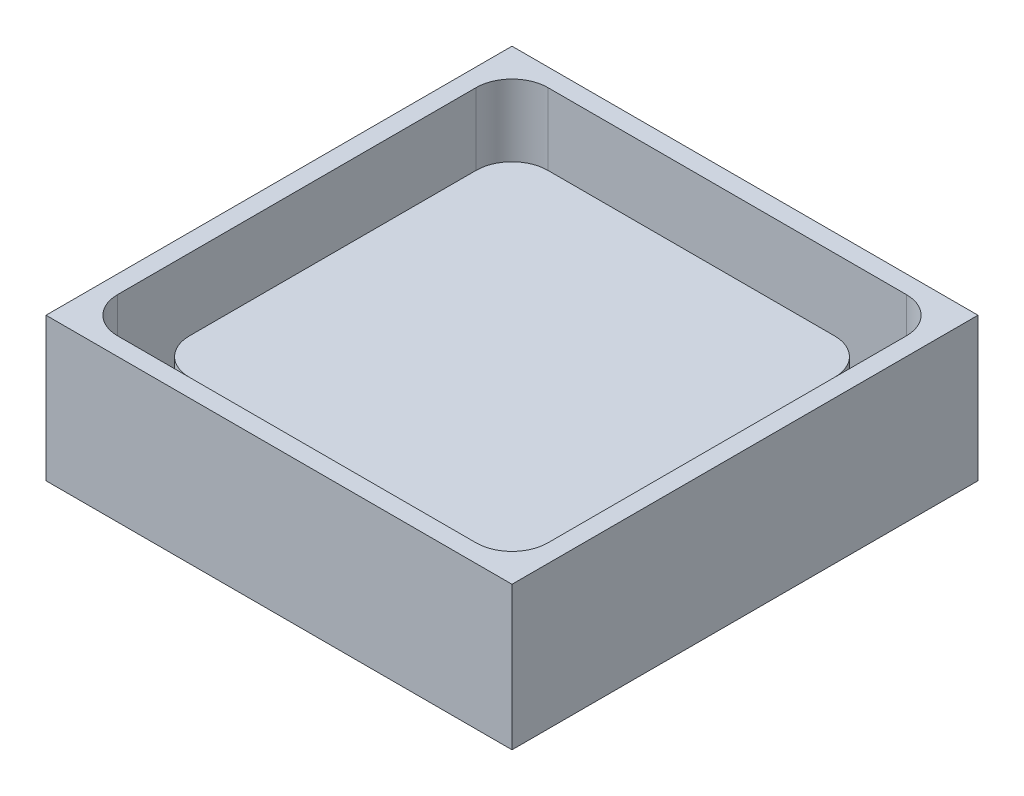
ISO-10303-21;
HEADER;
FILE_DESCRIPTION(('STEP AP214'),'2;1');
FILE_NAME('part.step','',(''),(''),'','','');
FILE_SCHEMA(('AUTOMOTIVE_DESIGN { 1 0 10303 214 1 1 1 1 }'));
ENDSEC;
DATA;
#1=APPLICATION_CONTEXT('core data for automotive mechanical design processes');
#2=APPLICATION_PROTOCOL_DEFINITION('international standard','automotive_design',2000,#1);
#3=PRODUCT_CONTEXT('',#1,'mechanical');
#4=PRODUCT('Part','Part','',(#3));
#5=PRODUCT_RELATED_PRODUCT_CATEGORY('part','',(#4));
#6=PRODUCT_DEFINITION_FORMATION('','',#4);
#7=PRODUCT_DEFINITION_CONTEXT('part definition',#1,'design');
#8=PRODUCT_DEFINITION('design','',#6,#7);
#9=PRODUCT_DEFINITION_SHAPE('','',#8);
#10=(LENGTH_UNIT() NAMED_UNIT(*) SI_UNIT(.MILLI.,.METRE.));
#11=(NAMED_UNIT(*) PLANE_ANGLE_UNIT() SI_UNIT($,.RADIAN.));
#12=(NAMED_UNIT(*) SI_UNIT($,.STERADIAN.) SOLID_ANGLE_UNIT());
#13=UNCERTAINTY_MEASURE_WITH_UNIT(LENGTH_MEASURE(1.E-05),#10,'distance_accuracy_value','');
#14=(GEOMETRIC_REPRESENTATION_CONTEXT(3) GLOBAL_UNCERTAINTY_ASSIGNED_CONTEXT((#13)) GLOBAL_UNIT_ASSIGNED_CONTEXT((#10,
#11,#12)) REPRESENTATION_CONTEXT('',''));
#15=CARTESIAN_POINT('',(0.,0.,0.));
#16=DIRECTION('',(0.,0.,1.));
#17=DIRECTION('',(1.,0.,0.));
#18=AXIS2_PLACEMENT_3D('',#15,#16,#17);
#19=CARTESIAN_POINT('',(10.,6.,10.));
#20=DIRECTION('',(-1.,0.,0.));
#21=DIRECTION('',(0.,0.,1.));
#22=AXIS2_PLACEMENT_3D('',#19,#20,#21);
#23=PLANE('',#22);
#24=DIRECTION('',(0.,0.,-1.));
#25=VECTOR('',#24,1.);
#26=CARTESIAN_POINT('',(10.,6.,10.));
#27=LINE('',#26,#25);
#28=CARTESIAN_POINT('',(10.,6.,8.));
#29=VERTEX_POINT('',#28);
#30=CARTESIAN_POINT('',(10.,6.,-8.));
#31=VERTEX_POINT('',#30);
#32=EDGE_CURVE('E226',#29,#31,#27,.T.);
#33=ORIENTED_EDGE('',*,*,#32,.F.);
#34=DIRECTION('',(0.,-1.,0.));
#35=VECTOR('',#34,1.);
#36=CARTESIAN_POINT('',(10.,6.,8.));
#37=LINE('',#36,#35);
#38=CARTESIAN_POINT('',(10.,1.,8.));
#39=VERTEX_POINT('',#38);
#40=EDGE_CURVE('E261',#29,#39,#37,.T.);
#41=ORIENTED_EDGE('',*,*,#40,.T.);
#42=DIRECTION('',(0.,0.,-1.));
#43=VECTOR('',#42,1.);
#44=CARTESIAN_POINT('',(10.,1.,10.));
#45=LINE('',#44,#43);
#46=CARTESIAN_POINT('',(10.,1.,-8.));
#47=VERTEX_POINT('',#46);
#48=EDGE_CURVE('E223',#39,#47,#45,.T.);
#49=ORIENTED_EDGE('',*,*,#48,.T.);
#50=DIRECTION('',(0.,-1.,0.));
#51=VECTOR('',#50,1.);
#52=CARTESIAN_POINT('',(10.,6.,-8.));
#53=LINE('',#52,#51);
#54=EDGE_CURVE('E259',#47,#31,#53,.F.);
#55=ORIENTED_EDGE('',*,*,#54,.T.);
#56=EDGE_LOOP('',(#33,#41,#49,#55));
#57=FACE_BOUND('',#56,.T.);
#58=ADVANCED_FACE('F39',(#57),#23,.F.);
#59=CARTESIAN_POINT('',(-10.,6.,-10.));
#60=DIRECTION('',(0.,0.,1.));
#61=DIRECTION('',(1.,0.,0.));
#62=AXIS2_PLACEMENT_3D('',#59,#60,#61);
#63=PLANE('',#62);
#64=DIRECTION('',(-1.,0.,0.));
#65=VECTOR('',#64,1.);
#66=CARTESIAN_POINT('',(-10.,6.,-10.));
#67=LINE('',#66,#65);
#68=CARTESIAN_POINT('',(8.,6.,-10.));
#69=VERTEX_POINT('',#68);
#70=CARTESIAN_POINT('',(-8.,6.,-10.));
#71=VERTEX_POINT('',#70);
#72=EDGE_CURVE('E229',#69,#71,#67,.T.);
#73=ORIENTED_EDGE('',*,*,#72,.F.);
#74=DIRECTION('',(0.,-1.,0.));
#75=VECTOR('',#74,1.);
#76=CARTESIAN_POINT('',(8.,6.,-10.));
#77=LINE('',#76,#75);
#78=CARTESIAN_POINT('',(8.,1.,-10.));
#79=VERTEX_POINT('',#78);
#80=EDGE_CURVE('E266',#69,#79,#77,.T.);
#81=ORIENTED_EDGE('',*,*,#80,.T.);
#82=DIRECTION('',(-1.,0.,0.));
#83=VECTOR('',#82,1.);
#84=CARTESIAN_POINT('',(-10.,1.,-10.));
#85=LINE('',#84,#83);
#86=CARTESIAN_POINT('',(-8.,1.,-10.));
#87=VERTEX_POINT('',#86);
#88=EDGE_CURVE('E220',#79,#87,#85,.T.);
#89=ORIENTED_EDGE('',*,*,#88,.T.);
#90=DIRECTION('',(0.,-1.,0.));
#91=VECTOR('',#90,1.);
#92=CARTESIAN_POINT('',(-8.,6.,-10.));
#93=LINE('',#92,#91);
#94=EDGE_CURVE('E264',#87,#71,#93,.F.);
#95=ORIENTED_EDGE('',*,*,#94,.T.);
#96=EDGE_LOOP('',(#73,#81,#89,#95));
#97=FACE_BOUND('',#96,.T.);
#98=ADVANCED_FACE('F380',(#97),#63,.F.);
#99=CARTESIAN_POINT('',(-10.,6.,10.));
#100=DIRECTION('',(1.,0.,0.));
#101=DIRECTION('',(0.,0.,-1.));
#102=AXIS2_PLACEMENT_3D('',#99,#100,#101);
#103=PLANE('',#102);
#104=DIRECTION('',(0.,0.,1.));
#105=VECTOR('',#104,1.);
#106=CARTESIAN_POINT('',(-10.,1.,10.));
#107=LINE('',#106,#105);
#108=CARTESIAN_POINT('',(-10.,1.,-8.));
#109=VERTEX_POINT('',#108);
#110=CARTESIAN_POINT('',(-10.,1.,8.));
#111=VERTEX_POINT('',#110);
#112=EDGE_CURVE('E217',#109,#111,#107,.T.);
#113=ORIENTED_EDGE('',*,*,#112,.T.);
#114=DIRECTION('',(0.,-1.,0.));
#115=VECTOR('',#114,1.);
#116=CARTESIAN_POINT('',(-10.,6.,8.));
#117=LINE('',#116,#115);
#118=CARTESIAN_POINT('',(-10.,6.,8.));
#119=VERTEX_POINT('',#118);
#120=EDGE_CURVE('E249',#111,#119,#117,.F.);
#121=ORIENTED_EDGE('',*,*,#120,.T.);
#122=DIRECTION('',(0.,0.,1.));
#123=VECTOR('',#122,1.);
#124=CARTESIAN_POINT('',(-10.,6.,10.));
#125=LINE('',#124,#123);
#126=CARTESIAN_POINT('',(-10.,6.,-8.));
#127=VERTEX_POINT('',#126);
#128=EDGE_CURVE('E232',#127,#119,#125,.T.);
#129=ORIENTED_EDGE('',*,*,#128,.F.);
#130=DIRECTION('',(0.,-1.,0.));
#131=VECTOR('',#130,1.);
#132=CARTESIAN_POINT('',(-10.,6.,-8.));
#133=LINE('',#132,#131);
#134=EDGE_CURVE('E246',#127,#109,#133,.T.);
#135=ORIENTED_EDGE('',*,*,#134,.T.);
#136=EDGE_LOOP('',(#113,#121,#129,#135));
#137=FACE_BOUND('',#136,.T.);
#138=ADVANCED_FACE('F387',(#137),#103,.F.);
#139=CARTESIAN_POINT('',(-10.,6.,10.));
#140=DIRECTION('',(0.,0.,-1.));
#141=DIRECTION('',(-1.,0.,0.));
#142=AXIS2_PLACEMENT_3D('',#139,#140,#141);
#143=PLANE('',#142);
#144=DIRECTION('',(1.,0.,0.));
#145=VECTOR('',#144,1.);
#146=CARTESIAN_POINT('',(-10.,6.,10.));
#147=LINE('',#146,#145);
#148=CARTESIAN_POINT('',(-8.,6.,10.));
#149=VERTEX_POINT('',#148);
#150=CARTESIAN_POINT('',(8.,6.,10.));
#151=VERTEX_POINT('',#150);
#152=EDGE_CURVE('E235',#149,#151,#147,.T.);
#153=ORIENTED_EDGE('',*,*,#152,.F.);
#154=DIRECTION('',(0.,-1.,0.));
#155=VECTOR('',#154,1.);
#156=CARTESIAN_POINT('',(-8.,6.,10.));
#157=LINE('',#156,#155);
#158=CARTESIAN_POINT('',(-8.,1.,10.));
#159=VERTEX_POINT('',#158);
#160=EDGE_CURVE('E243',#149,#159,#157,.T.);
#161=ORIENTED_EDGE('',*,*,#160,.T.);
#162=DIRECTION('',(1.,0.,0.));
#163=VECTOR('',#162,1.);
#164=CARTESIAN_POINT('',(-10.,1.,10.));
#165=LINE('',#164,#163);
#166=CARTESIAN_POINT('',(8.,1.,10.));
#167=VERTEX_POINT('',#166);
#168=EDGE_CURVE('E238',#159,#167,#165,.T.);
#169=ORIENTED_EDGE('',*,*,#168,.T.);
#170=DIRECTION('',(0.,-1.,0.));
#171=VECTOR('',#170,1.);
#172=CARTESIAN_POINT('',(8.,6.,10.));
#173=LINE('',#172,#171);
#174=EDGE_CURVE('E241',#167,#151,#173,.F.);
#175=ORIENTED_EDGE('',*,*,#174,.T.);
#176=EDGE_LOOP('',(#153,#161,#169,#175));
#177=FACE_BOUND('',#176,.T.);
#178=ADVANCED_FACE('F554',(#177),#143,.F.);
#179=CARTESIAN_POINT('',(0.,6.,0.));
#180=DIRECTION('',(0.,-1.,0.));
#181=DIRECTION('',(0.,0.,-1.));
#182=AXIS2_PLACEMENT_3D('',#179,#180,#181);
#183=PLANE('',#182);
#184=ORIENTED_EDGE('',*,*,#128,.T.);
#185=CARTESIAN_POINT('',(-8.,6.,8.));
#186=DIRECTION('',(0.,-1.,0.));
#187=DIRECTION('',(0.,0.,-1.));
#188=AXIS2_PLACEMENT_3D('',#185,#186,#187);
#189=CIRCLE('',#188,2.);
#190=EDGE_CURVE('E257',#119,#149,#189,.F.);
#191=ORIENTED_EDGE('',*,*,#190,.T.);
#192=ORIENTED_EDGE('',*,*,#152,.T.);
#193=CARTESIAN_POINT('',(8.,6.,8.));
#194=DIRECTION('',(0.,-1.,0.));
#195=DIRECTION('',(0.,0.,-1.));
#196=AXIS2_PLACEMENT_3D('',#193,#194,#195);
#197=CIRCLE('',#196,2.);
#198=EDGE_CURVE('E255',#151,#29,#197,.F.);
#199=ORIENTED_EDGE('',*,*,#198,.T.);
#200=ORIENTED_EDGE('',*,*,#32,.T.);
#201=CARTESIAN_POINT('',(8.,6.,-8.));
#202=DIRECTION('',(0.,-1.,0.));
#203=DIRECTION('',(0.,0.,-1.));
#204=AXIS2_PLACEMENT_3D('',#201,#202,#203);
#205=CIRCLE('',#204,2.);
#206=EDGE_CURVE('E253',#31,#69,#205,.F.);
#207=ORIENTED_EDGE('',*,*,#206,.T.);
#208=ORIENTED_EDGE('',*,*,#72,.T.);
#209=CARTESIAN_POINT('',(-8.,6.,-8.));
#210=DIRECTION('',(0.,-1.,0.));
#211=DIRECTION('',(0.,0.,-1.));
#212=AXIS2_PLACEMENT_3D('',#209,#210,#211);
#213=CIRCLE('',#212,2.);
#214=EDGE_CURVE('E251',#71,#127,#213,.F.);
#215=ORIENTED_EDGE('',*,*,#214,.T.);
#216=EDGE_LOOP('',(#184,#191,#192,#199,#200,#207,#208,#215));
#217=FACE_BOUND('',#216,.T.);
#218=ADVANCED_FACE('F540',(#217),#183,.F.);
#219=CARTESIAN_POINT('',(0.,1.,0.));
#220=DIRECTION('',(0.,1.,0.));
#221=DIRECTION('',(0.,0.,1.));
#222=AXIS2_PLACEMENT_3D('',#219,#220,#221);
#223=PLANE('',#222);
#224=DIRECTION('',(1.,0.,0.));
#225=VECTOR('',#224,1.);
#226=CARTESIAN_POINT('',(-12.,1.,12.));
#227=LINE('',#226,#225);
#228=CARTESIAN_POINT('',(-10.,1.,12.));
#229=VERTEX_POINT('',#228);
#230=CARTESIAN_POINT('',(10.,1.,12.));
#231=VERTEX_POINT('',#230);
#232=EDGE_CURVE('E211',#229,#231,#227,.T.);
#233=ORIENTED_EDGE('',*,*,#232,.T.);
#234=CARTESIAN_POINT('',(10.,1.,10.));
#235=DIRECTION('',(0.,1.,0.));
#236=DIRECTION('',(0.,0.,1.));
#237=AXIS2_PLACEMENT_3D('',#234,#235,#236);
#238=CIRCLE('',#237,2.);
#239=CARTESIAN_POINT('',(12.,1.,10.));
#240=VERTEX_POINT('',#239);
#241=EDGE_CURVE('E288',#231,#240,#238,.T.);
#242=ORIENTED_EDGE('',*,*,#241,.T.);
#243=DIRECTION('',(0.,0.,-1.));
#244=VECTOR('',#243,1.);
#245=CARTESIAN_POINT('',(12.,1.,12.));
#246=LINE('',#245,#244);
#247=CARTESIAN_POINT('',(12.,1.,-10.));
#248=VERTEX_POINT('',#247);
#249=EDGE_CURVE('E203',#240,#248,#246,.T.);
#250=ORIENTED_EDGE('',*,*,#249,.T.);
#251=CARTESIAN_POINT('',(10.,1.,-10.));
#252=DIRECTION('',(0.,1.,0.));
#253=DIRECTION('',(0.,0.,1.));
#254=AXIS2_PLACEMENT_3D('',#251,#252,#253);
#255=CIRCLE('',#254,2.);
#256=CARTESIAN_POINT('',(10.,1.,-12.));
#257=VERTEX_POINT('',#256);
#258=EDGE_CURVE('E284',#248,#257,#255,.T.);
#259=ORIENTED_EDGE('',*,*,#258,.T.);
#260=DIRECTION('',(1.,0.,0.));
#261=VECTOR('',#260,1.);
#262=CARTESIAN_POINT('',(-12.,1.,-12.));
#263=LINE('',#262,#261);
#264=CARTESIAN_POINT('',(-10.,1.,-12.));
#265=VERTEX_POINT('',#264);
#266=EDGE_CURVE('E201',#265,#257,#263,.T.);
#267=ORIENTED_EDGE('',*,*,#266,.F.);
#268=CARTESIAN_POINT('',(-10.,1.,-10.));
#269=DIRECTION('',(0.,1.,0.));
#270=DIRECTION('',(0.,0.,1.));
#271=AXIS2_PLACEMENT_3D('',#268,#269,#270);
#272=CIRCLE('',#271,2.);
#273=CARTESIAN_POINT('',(-12.,1.,-10.));
#274=VERTEX_POINT('',#273);
#275=EDGE_CURVE('E282',#265,#274,#272,.T.);
#276=ORIENTED_EDGE('',*,*,#275,.T.);
#277=DIRECTION('',(0.,0.,-1.));
#278=VECTOR('',#277,1.);
#279=CARTESIAN_POINT('',(-12.,1.,12.));
#280=LINE('',#279,#278);
#281=CARTESIAN_POINT('',(-12.,1.,10.));
#282=VERTEX_POINT('',#281);
#283=EDGE_CURVE('E214',#282,#274,#280,.T.);
#284=ORIENTED_EDGE('',*,*,#283,.F.);
#285=CARTESIAN_POINT('',(-10.,1.,10.));
#286=DIRECTION('',(0.,1.,0.));
#287=DIRECTION('',(0.,0.,1.));
#288=AXIS2_PLACEMENT_3D('',#285,#286,#287);
#289=CIRCLE('',#288,2.);
#290=EDGE_CURVE('E286',#282,#229,#289,.T.);
#291=ORIENTED_EDGE('',*,*,#290,.T.);
#292=EDGE_LOOP('',(#233,#242,#250,#259,#267,#276,#284,#291));
#293=FACE_BOUND('',#292,.T.);
#294=ORIENTED_EDGE('',*,*,#48,.F.);
#295=CARTESIAN_POINT('',(8.,1.,8.));
#296=DIRECTION('',(0.,1.,0.));
#297=DIRECTION('',(0.,0.,1.));
#298=AXIS2_PLACEMENT_3D('',#295,#296,#297);
#299=CIRCLE('',#298,2.);
#300=EDGE_CURVE('E271',#39,#167,#299,.F.);
#301=ORIENTED_EDGE('',*,*,#300,.T.);
#302=ORIENTED_EDGE('',*,*,#168,.F.);
#303=CARTESIAN_POINT('',(-8.,1.,8.));
#304=DIRECTION('',(0.,1.,0.));
#305=DIRECTION('',(0.,0.,1.));
#306=AXIS2_PLACEMENT_3D('',#303,#304,#305);
#307=CIRCLE('',#306,2.);
#308=EDGE_CURVE('E269',#159,#111,#307,.F.);
#309=ORIENTED_EDGE('',*,*,#308,.T.);
#310=ORIENTED_EDGE('',*,*,#112,.F.);
#311=CARTESIAN_POINT('',(-8.,1.,-8.));
#312=DIRECTION('',(0.,1.,0.));
#313=DIRECTION('',(0.,0.,1.));
#314=AXIS2_PLACEMENT_3D('',#311,#312,#313);
#315=CIRCLE('',#314,2.);
#316=EDGE_CURVE('E275',#109,#87,#315,.F.);
#317=ORIENTED_EDGE('',*,*,#316,.T.);
#318=ORIENTED_EDGE('',*,*,#88,.F.);
#319=CARTESIAN_POINT('',(8.,1.,-8.));
#320=DIRECTION('',(0.,1.,0.));
#321=DIRECTION('',(0.,0.,1.));
#322=AXIS2_PLACEMENT_3D('',#319,#320,#321);
#323=CIRCLE('',#322,2.);
#324=EDGE_CURVE('E273',#79,#47,#323,.F.);
#325=ORIENTED_EDGE('',*,*,#324,.T.);
#326=EDGE_LOOP('',(#294,#301,#302,#309,#310,#317,#318,#325));
#327=FACE_BOUND('',#326,.T.);
#328=ADVANCED_FACE('F323',(#293,#327),#223,.T.);
#329=CARTESIAN_POINT('',(0.,8.,0.));
#330=DIRECTION('',(0.,-1.,0.));
#331=DIRECTION('',(0.,0.,-1.));
#332=AXIS2_PLACEMENT_3D('',#329,#330,#331);
#333=PLANE('',#332);
#334=DIRECTION('',(0.,0.,-1.));
#335=VECTOR('',#334,1.);
#336=CARTESIAN_POINT('',(13.,8.,13.));
#337=LINE('',#336,#335);
#338=CARTESIAN_POINT('',(13.,8.,13.));
#339=VERTEX_POINT('',#338);
#340=CARTESIAN_POINT('',(13.,8.,-13.));
#341=VERTEX_POINT('',#340);
#342=EDGE_CURVE('E187',#339,#341,#337,.T.);
#343=ORIENTED_EDGE('',*,*,#342,.T.);
#344=DIRECTION('',(-1.,0.,0.));
#345=VECTOR('',#344,1.);
#346=CARTESIAN_POINT('',(-13.,8.,-13.));
#347=LINE('',#346,#345);
#348=CARTESIAN_POINT('',(-13.,8.,-13.));
#349=VERTEX_POINT('',#348);
#350=EDGE_CURVE('E176',#341,#349,#347,.T.);
#351=ORIENTED_EDGE('',*,*,#350,.T.);
#352=DIRECTION('',(0.,0.,1.));
#353=VECTOR('',#352,1.);
#354=CARTESIAN_POINT('',(-13.,8.,13.));
#355=LINE('',#354,#353);
#356=CARTESIAN_POINT('',(-13.,8.,13.));
#357=VERTEX_POINT('',#356);
#358=EDGE_CURVE('E186',#349,#357,#355,.T.);
#359=ORIENTED_EDGE('',*,*,#358,.T.);
#360=DIRECTION('',(1.,0.,0.));
#361=VECTOR('',#360,1.);
#362=CARTESIAN_POINT('',(-13.,8.,13.));
#363=LINE('',#362,#361);
#364=EDGE_CURVE('E192',#357,#339,#363,.T.);
#365=ORIENTED_EDGE('',*,*,#364,.T.);
#366=EDGE_LOOP('',(#343,#351,#359,#365));
#367=FACE_BOUND('',#366,.T.);
#368=DIRECTION('',(0.,0.,-1.));
#369=VECTOR('',#368,1.);
#370=CARTESIAN_POINT('',(12.,8.,12.));
#371=LINE('',#370,#369);
#372=CARTESIAN_POINT('',(12.,8.,10.));
#373=VERTEX_POINT('',#372);
#374=CARTESIAN_POINT('',(12.,8.,-10.));
#375=VERTEX_POINT('',#374);
#376=EDGE_CURVE('E310',#373,#375,#371,.T.);
#377=ORIENTED_EDGE('',*,*,#376,.F.);
#378=CARTESIAN_POINT('',(10.,8.,10.));
#379=DIRECTION('',(0.,-1.,0.));
#380=DIRECTION('',(0.,0.,-1.));
#381=AXIS2_PLACEMENT_3D('',#378,#379,#380);
#382=CIRCLE('',#381,2.);
#383=CARTESIAN_POINT('',(10.,8.,12.));
#384=VERTEX_POINT('',#383);
#385=EDGE_CURVE('E304',#373,#384,#382,.T.);
#386=ORIENTED_EDGE('',*,*,#385,.T.);
#387=DIRECTION('',(1.,0.,0.));
#388=VECTOR('',#387,1.);
#389=CARTESIAN_POINT('',(-12.,8.,12.));
#390=LINE('',#389,#388);
#391=CARTESIAN_POINT('',(-10.,8.,12.));
#392=VERTEX_POINT('',#391);
#393=EDGE_CURVE('E345',#392,#384,#390,.T.);
#394=ORIENTED_EDGE('',*,*,#393,.F.);
#395=CARTESIAN_POINT('',(-10.,8.,10.));
#396=DIRECTION('',(0.,-1.,0.));
#397=DIRECTION('',(0.,0.,-1.));
#398=AXIS2_PLACEMENT_3D('',#395,#396,#397);
#399=CIRCLE('',#398,2.);
#400=CARTESIAN_POINT('',(-12.,8.,10.));
#401=VERTEX_POINT('',#400);
#402=EDGE_CURVE('E306',#392,#401,#399,.T.);
#403=ORIENTED_EDGE('',*,*,#402,.T.);
#404=DIRECTION('',(0.,0.,1.));
#405=VECTOR('',#404,1.);
#406=CARTESIAN_POINT('',(-12.,8.,12.));
#407=LINE('',#406,#405);
#408=CARTESIAN_POINT('',(-12.,8.,-10.));
#409=VERTEX_POINT('',#408);
#410=EDGE_CURVE('E334',#409,#401,#407,.T.);
#411=ORIENTED_EDGE('',*,*,#410,.F.);
#412=CARTESIAN_POINT('',(-10.,8.,-10.));
#413=DIRECTION('',(0.,-1.,0.));
#414=DIRECTION('',(0.,0.,-1.));
#415=AXIS2_PLACEMENT_3D('',#412,#413,#414);
#416=CIRCLE('',#415,2.);
#417=CARTESIAN_POINT('',(-10.,8.,-12.));
#418=VERTEX_POINT('',#417);
#419=EDGE_CURVE('E11',#409,#418,#416,.T.);
#420=ORIENTED_EDGE('',*,*,#419,.T.);
#421=DIRECTION('',(-1.,0.,0.));
#422=VECTOR('',#421,1.);
#423=CARTESIAN_POINT('',(-12.,8.,-12.));
#424=LINE('',#423,#422);
#425=CARTESIAN_POINT('',(10.,8.,-12.));
#426=VERTEX_POINT('',#425);
#427=EDGE_CURVE('E312',#426,#418,#424,.T.);
#428=ORIENTED_EDGE('',*,*,#427,.F.);
#429=CARTESIAN_POINT('',(10.,8.,-10.));
#430=DIRECTION('',(0.,-1.,0.));
#431=DIRECTION('',(0.,0.,-1.));
#432=AXIS2_PLACEMENT_3D('',#429,#430,#431);
#433=CIRCLE('',#432,2.);
#434=EDGE_CURVE('E47',#426,#375,#433,.T.);
#435=ORIENTED_EDGE('',*,*,#434,.T.);
#436=EDGE_LOOP('',(#377,#386,#394,#403,#411,#420,#428,#435));
#437=FACE_BOUND('',#436,.T.);
#438=ADVANCED_FACE('F190',(#367,#437),#333,.F.);
#439=CARTESIAN_POINT('',(13.,8.,13.));
#440=DIRECTION('',(-1.,0.,0.));
#441=DIRECTION('',(0.,0.,1.));
#442=AXIS2_PLACEMENT_3D('',#439,#440,#441);
#443=PLANE('',#442);
#444=DIRECTION('',(0.,0.,-1.));
#445=VECTOR('',#444,1.);
#446=CARTESIAN_POINT('',(13.,0.,13.));
#447=LINE('',#446,#445);
#448=CARTESIAN_POINT('',(13.,0.,13.));
#449=VERTEX_POINT('',#448);
#450=CARTESIAN_POINT('',(13.,0.,-13.));
#451=VERTEX_POINT('',#450);
#452=EDGE_CURVE('E200',#449,#451,#447,.T.);
#453=ORIENTED_EDGE('',*,*,#452,.T.);
#454=DIRECTION('',(0.,-1.,0.));
#455=VECTOR('',#454,1.);
#456=CARTESIAN_POINT('',(13.,8.,-13.));
#457=LINE('',#456,#455);
#458=EDGE_CURVE('E180',#341,#451,#457,.T.);
#459=ORIENTED_EDGE('',*,*,#458,.F.);
#460=ORIENTED_EDGE('',*,*,#342,.F.);
#461=DIRECTION('',(0.,-1.,0.));
#462=VECTOR('',#461,1.);
#463=CARTESIAN_POINT('',(13.,8.,13.));
#464=LINE('',#463,#462);
#465=EDGE_CURVE('E355',#339,#449,#464,.T.);
#466=ORIENTED_EDGE('',*,*,#465,.T.);
#467=EDGE_LOOP('',(#453,#459,#460,#466));
#468=FACE_BOUND('',#467,.T.);
#469=ADVANCED_FACE('F198',(#468),#443,.F.);
#470=CARTESIAN_POINT('',(-13.,8.,-13.));
#471=DIRECTION('',(0.,0.,1.));
#472=DIRECTION('',(1.,0.,0.));
#473=AXIS2_PLACEMENT_3D('',#470,#471,#472);
#474=PLANE('',#473);
#475=DIRECTION('',(-1.,0.,0.));
#476=VECTOR('',#475,1.);
#477=CARTESIAN_POINT('',(-13.,0.,-13.));
#478=LINE('',#477,#476);
#479=CARTESIAN_POINT('',(-13.,0.,-13.));
#480=VERTEX_POINT('',#479);
#481=EDGE_CURVE('E349',#451,#480,#478,.T.);
#482=ORIENTED_EDGE('',*,*,#481,.T.);
#483=DIRECTION('',(0.,-1.,0.));
#484=VECTOR('',#483,1.);
#485=CARTESIAN_POINT('',(-13.,8.,-13.));
#486=LINE('',#485,#484);
#487=EDGE_CURVE('E183',#349,#480,#486,.T.);
#488=ORIENTED_EDGE('',*,*,#487,.F.);
#489=ORIENTED_EDGE('',*,*,#350,.F.);
#490=ORIENTED_EDGE('',*,*,#458,.T.);
#491=EDGE_LOOP('',(#482,#488,#489,#490));
#492=FACE_BOUND('',#491,.T.);
#493=ADVANCED_FACE('F178',(#492),#474,.F.);
#494=CARTESIAN_POINT('',(-13.,8.,13.));
#495=DIRECTION('',(1.,0.,0.));
#496=DIRECTION('',(0.,0.,-1.));
#497=AXIS2_PLACEMENT_3D('',#494,#495,#496);
#498=PLANE('',#497);
#499=DIRECTION('',(0.,0.,1.));
#500=VECTOR('',#499,1.);
#501=CARTESIAN_POINT('',(-13.,0.,13.));
#502=LINE('',#501,#500);
#503=CARTESIAN_POINT('',(-13.,0.,13.));
#504=VERTEX_POINT('',#503);
#505=EDGE_CURVE('E358',#480,#504,#502,.T.);
#506=ORIENTED_EDGE('',*,*,#505,.T.);
#507=DIRECTION('',(0.,-1.,0.));
#508=VECTOR('',#507,1.);
#509=CARTESIAN_POINT('',(-13.,8.,13.));
#510=LINE('',#509,#508);
#511=EDGE_CURVE('E205',#357,#504,#510,.T.);
#512=ORIENTED_EDGE('',*,*,#511,.F.);
#513=ORIENTED_EDGE('',*,*,#358,.F.);
#514=ORIENTED_EDGE('',*,*,#487,.T.);
#515=EDGE_LOOP('',(#506,#512,#513,#514));
#516=FACE_BOUND('',#515,.T.);
#517=ADVANCED_FACE('F370',(#516),#498,.F.);
#518=CARTESIAN_POINT('',(-13.,8.,13.));
#519=DIRECTION('',(0.,0.,-1.));
#520=DIRECTION('',(-1.,0.,0.));
#521=AXIS2_PLACEMENT_3D('',#518,#519,#520);
#522=PLANE('',#521);
#523=DIRECTION('',(1.,0.,0.));
#524=VECTOR('',#523,1.);
#525=CARTESIAN_POINT('',(-13.,0.,13.));
#526=LINE('',#525,#524);
#527=EDGE_CURVE('E196',#504,#449,#526,.T.);
#528=ORIENTED_EDGE('',*,*,#527,.T.);
#529=ORIENTED_EDGE('',*,*,#465,.F.);
#530=ORIENTED_EDGE('',*,*,#364,.F.);
#531=ORIENTED_EDGE('',*,*,#511,.T.);
#532=EDGE_LOOP('',(#528,#529,#530,#531));
#533=FACE_BOUND('',#532,.T.);
#534=ADVANCED_FACE('F365',(#533),#522,.F.);
#535=CARTESIAN_POINT('',(12.,8.,12.));
#536=DIRECTION('',(-1.,0.,0.));
#537=DIRECTION('',(0.,0.,1.));
#538=AXIS2_PLACEMENT_3D('',#535,#536,#537);
#539=PLANE('',#538);
#540=ORIENTED_EDGE('',*,*,#249,.F.);
#541=DIRECTION('',(0.,-1.,0.));
#542=VECTOR('',#541,1.);
#543=CARTESIAN_POINT('',(12.,8.,10.));
#544=LINE('',#543,#542);
#545=EDGE_CURVE('E293',#240,#373,#544,.F.);
#546=ORIENTED_EDGE('',*,*,#545,.T.);
#547=ORIENTED_EDGE('',*,*,#376,.T.);
#548=DIRECTION('',(0.,-1.,0.));
#549=VECTOR('',#548,1.);
#550=CARTESIAN_POINT('',(12.,1.,-10.));
#551=LINE('',#550,#549);
#552=EDGE_CURVE('E290',#375,#248,#551,.T.);
#553=ORIENTED_EDGE('',*,*,#552,.T.);
#554=EDGE_LOOP('',(#540,#546,#547,#553));
#555=FACE_BOUND('',#554,.T.);
#556=ADVANCED_FACE('F317',(#555),#539,.T.);
#557=CARTESIAN_POINT('',(-12.,8.,-12.));
#558=DIRECTION('',(0.,0.,1.));
#559=DIRECTION('',(1.,0.,0.));
#560=AXIS2_PLACEMENT_3D('',#557,#558,#559);
#561=PLANE('',#560);
#562=ORIENTED_EDGE('',*,*,#266,.T.);
#563=DIRECTION('',(0.,-1.,0.));
#564=VECTOR('',#563,1.);
#565=CARTESIAN_POINT('',(10.,8.,-12.));
#566=LINE('',#565,#564);
#567=EDGE_CURVE('E59',#257,#426,#566,.F.);
#568=ORIENTED_EDGE('',*,*,#567,.T.);
#569=ORIENTED_EDGE('',*,*,#427,.T.);
#570=DIRECTION('',(0.,-1.,0.));
#571=VECTOR('',#570,1.);
#572=CARTESIAN_POINT('',(-10.,1.,-12.));
#573=LINE('',#572,#571);
#574=EDGE_CURVE('E300',#418,#265,#573,.T.);
#575=ORIENTED_EDGE('',*,*,#574,.T.);
#576=EDGE_LOOP('',(#562,#568,#569,#575));
#577=FACE_BOUND('',#576,.T.);
#578=ADVANCED_FACE('F325',(#577),#561,.T.);
#579=CARTESIAN_POINT('',(-12.,8.,12.));
#580=DIRECTION('',(1.,0.,0.));
#581=DIRECTION('',(0.,0.,-1.));
#582=AXIS2_PLACEMENT_3D('',#579,#580,#581);
#583=PLANE('',#582);
#584=ORIENTED_EDGE('',*,*,#410,.T.);
#585=DIRECTION('',(0.,-1.,0.));
#586=VECTOR('',#585,1.);
#587=CARTESIAN_POINT('',(-12.,1.,10.));
#588=LINE('',#587,#586);
#589=EDGE_CURVE('E297',#401,#282,#588,.T.);
#590=ORIENTED_EDGE('',*,*,#589,.T.);
#591=ORIENTED_EDGE('',*,*,#283,.T.);
#592=DIRECTION('',(0.,-1.,0.));
#593=VECTOR('',#592,1.);
#594=CARTESIAN_POINT('',(-12.,8.,-10.));
#595=LINE('',#594,#593);
#596=EDGE_CURVE('E295',#274,#409,#595,.F.);
#597=ORIENTED_EDGE('',*,*,#596,.T.);
#598=EDGE_LOOP('',(#584,#590,#591,#597));
#599=FACE_BOUND('',#598,.T.);
#600=ADVANCED_FACE('F332',(#599),#583,.T.);
#601=CARTESIAN_POINT('',(-12.,8.,12.));
#602=DIRECTION('',(0.,0.,-1.));
#603=DIRECTION('',(-1.,0.,0.));
#604=AXIS2_PLACEMENT_3D('',#601,#602,#603);
#605=PLANE('',#604);
#606=ORIENTED_EDGE('',*,*,#393,.T.);
#607=DIRECTION('',(0.,-1.,0.));
#608=VECTOR('',#607,1.);
#609=CARTESIAN_POINT('',(10.,1.,12.));
#610=LINE('',#609,#608);
#611=EDGE_CURVE('E279',#384,#231,#610,.T.);
#612=ORIENTED_EDGE('',*,*,#611,.T.);
#613=ORIENTED_EDGE('',*,*,#232,.F.);
#614=DIRECTION('',(0.,-1.,0.));
#615=VECTOR('',#614,1.);
#616=CARTESIAN_POINT('',(-10.,8.,12.));
#617=LINE('',#616,#615);
#618=EDGE_CURVE('E277',#229,#392,#617,.F.);
#619=ORIENTED_EDGE('',*,*,#618,.T.);
#620=EDGE_LOOP('',(#606,#612,#613,#619));
#621=FACE_BOUND('',#620,.T.);
#622=ADVANCED_FACE('F342',(#621),#605,.T.);
#623=CARTESIAN_POINT('',(0.,0.,0.));
#624=DIRECTION('',(0.,-1.,0.));
#625=DIRECTION('',(0.,0.,-1.));
#626=AXIS2_PLACEMENT_3D('',#623,#624,#625);
#627=PLANE('',#626);
#628=ORIENTED_EDGE('',*,*,#452,.F.);
#629=ORIENTED_EDGE('',*,*,#527,.F.);
#630=ORIENTED_EDGE('',*,*,#505,.F.);
#631=ORIENTED_EDGE('',*,*,#481,.F.);
#632=EDGE_LOOP('',(#628,#629,#630,#631));
#633=FACE_BOUND('',#632,.T.);
#634=ADVANCED_FACE('F369',(#633),#627,.T.);
#635=CARTESIAN_POINT('',(-8.,6.,8.));
#636=DIRECTION('',(0.,-1.,0.));
#637=DIRECTION('',(0.,0.,-1.));
#638=AXIS2_PLACEMENT_3D('',#635,#636,#637);
#639=CYLINDRICAL_SURFACE('',#638,2.);
#640=ORIENTED_EDGE('',*,*,#190,.F.);
#641=ORIENTED_EDGE('',*,*,#120,.F.);
#642=ORIENTED_EDGE('',*,*,#308,.F.);
#643=ORIENTED_EDGE('',*,*,#160,.F.);
#644=EDGE_LOOP('',(#640,#641,#642,#643));
#645=FACE_BOUND('',#644,.T.);
#646=ADVANCED_FACE('F393',(#645),#639,.T.);
#647=CARTESIAN_POINT('',(8.,6.,8.));
#648=DIRECTION('',(0.,-1.,0.));
#649=DIRECTION('',(0.,0.,-1.));
#650=AXIS2_PLACEMENT_3D('',#647,#648,#649);
#651=CYLINDRICAL_SURFACE('',#650,2.);
#652=ORIENTED_EDGE('',*,*,#198,.F.);
#653=ORIENTED_EDGE('',*,*,#174,.F.);
#654=ORIENTED_EDGE('',*,*,#300,.F.);
#655=ORIENTED_EDGE('',*,*,#40,.F.);
#656=EDGE_LOOP('',(#652,#653,#654,#655));
#657=FACE_BOUND('',#656,.T.);
#658=ADVANCED_FACE('F396',(#657),#651,.T.);
#659=CARTESIAN_POINT('',(8.,6.,-8.));
#660=DIRECTION('',(0.,-1.,0.));
#661=DIRECTION('',(0.,0.,-1.));
#662=AXIS2_PLACEMENT_3D('',#659,#660,#661);
#663=CYLINDRICAL_SURFACE('',#662,2.);
#664=ORIENTED_EDGE('',*,*,#206,.F.);
#665=ORIENTED_EDGE('',*,*,#54,.F.);
#666=ORIENTED_EDGE('',*,*,#324,.F.);
#667=ORIENTED_EDGE('',*,*,#80,.F.);
#668=EDGE_LOOP('',(#664,#665,#666,#667));
#669=FACE_BOUND('',#668,.T.);
#670=ADVANCED_FACE('F400',(#669),#663,.T.);
#671=CARTESIAN_POINT('',(-8.,6.,-8.));
#672=DIRECTION('',(0.,-1.,0.));
#673=DIRECTION('',(0.,0.,-1.));
#674=AXIS2_PLACEMENT_3D('',#671,#672,#673);
#675=CYLINDRICAL_SURFACE('',#674,2.);
#676=ORIENTED_EDGE('',*,*,#214,.F.);
#677=ORIENTED_EDGE('',*,*,#94,.F.);
#678=ORIENTED_EDGE('',*,*,#316,.F.);
#679=ORIENTED_EDGE('',*,*,#134,.F.);
#680=EDGE_LOOP('',(#676,#677,#678,#679));
#681=FACE_BOUND('',#680,.T.);
#682=ADVANCED_FACE('F404',(#681),#675,.T.);
#683=CARTESIAN_POINT('',(10.,8.,10.));
#684=DIRECTION('',(0.,1.,0.));
#685=DIRECTION('',(0.,0.,1.));
#686=AXIS2_PLACEMENT_3D('',#683,#684,#685);
#687=CYLINDRICAL_SURFACE('',#686,2.);
#688=ORIENTED_EDGE('',*,*,#385,.F.);
#689=ORIENTED_EDGE('',*,*,#545,.F.);
#690=ORIENTED_EDGE('',*,*,#241,.F.);
#691=ORIENTED_EDGE('',*,*,#611,.F.);
#692=EDGE_LOOP('',(#688,#689,#690,#691));
#693=FACE_BOUND('',#692,.T.);
#694=ADVANCED_FACE('F347',(#693),#687,.F.);
#695=CARTESIAN_POINT('',(-10.,8.,10.));
#696=DIRECTION('',(0.,1.,0.));
#697=DIRECTION('',(0.,0.,1.));
#698=AXIS2_PLACEMENT_3D('',#695,#696,#697);
#699=CYLINDRICAL_SURFACE('',#698,2.);
#700=ORIENTED_EDGE('',*,*,#402,.F.);
#701=ORIENTED_EDGE('',*,*,#618,.F.);
#702=ORIENTED_EDGE('',*,*,#290,.F.);
#703=ORIENTED_EDGE('',*,*,#589,.F.);
#704=EDGE_LOOP('',(#700,#701,#702,#703));
#705=FACE_BOUND('',#704,.T.);
#706=ADVANCED_FACE('F337',(#705),#699,.F.);
#707=CARTESIAN_POINT('',(10.,8.,-10.));
#708=DIRECTION('',(0.,1.,0.));
#709=DIRECTION('',(0.,0.,1.));
#710=AXIS2_PLACEMENT_3D('',#707,#708,#709);
#711=CYLINDRICAL_SURFACE('',#710,2.);
#712=ORIENTED_EDGE('',*,*,#434,.F.);
#713=ORIENTED_EDGE('',*,*,#567,.F.);
#714=ORIENTED_EDGE('',*,*,#258,.F.);
#715=ORIENTED_EDGE('',*,*,#552,.F.);
#716=EDGE_LOOP('',(#712,#713,#714,#715));
#717=FACE_BOUND('',#716,.T.);
#718=ADVANCED_FACE('F320',(#717),#711,.F.);
#719=CARTESIAN_POINT('',(-10.,8.,-10.));
#720=DIRECTION('',(0.,1.,0.));
#721=DIRECTION('',(0.,0.,1.));
#722=AXIS2_PLACEMENT_3D('',#719,#720,#721);
#723=CYLINDRICAL_SURFACE('',#722,2.);
#724=ORIENTED_EDGE('',*,*,#419,.F.);
#725=ORIENTED_EDGE('',*,*,#596,.F.);
#726=ORIENTED_EDGE('',*,*,#275,.F.);
#727=ORIENTED_EDGE('',*,*,#574,.F.);
#728=EDGE_LOOP('',(#724,#725,#726,#727));
#729=FACE_BOUND('',#728,.T.);
#730=ADVANCED_FACE('F41',(#729),#723,.F.);
#731=CLOSED_SHELL('',(#58,#98,#138,#178,#218,#328,#438,#469,#493,#517,#534,#556,#578,#600,#622,
#634,#646,#658,#670,#682,#694,#706,#718,#730));
#732=MANIFOLD_SOLID_BREP('B2',#731);
#733=ADVANCED_BREP_SHAPE_REPRESENTATION('',(#18,#732),#14);
#734=SHAPE_DEFINITION_REPRESENTATION(#9,#733);
ENDSEC;
END-ISO-10303-21;
